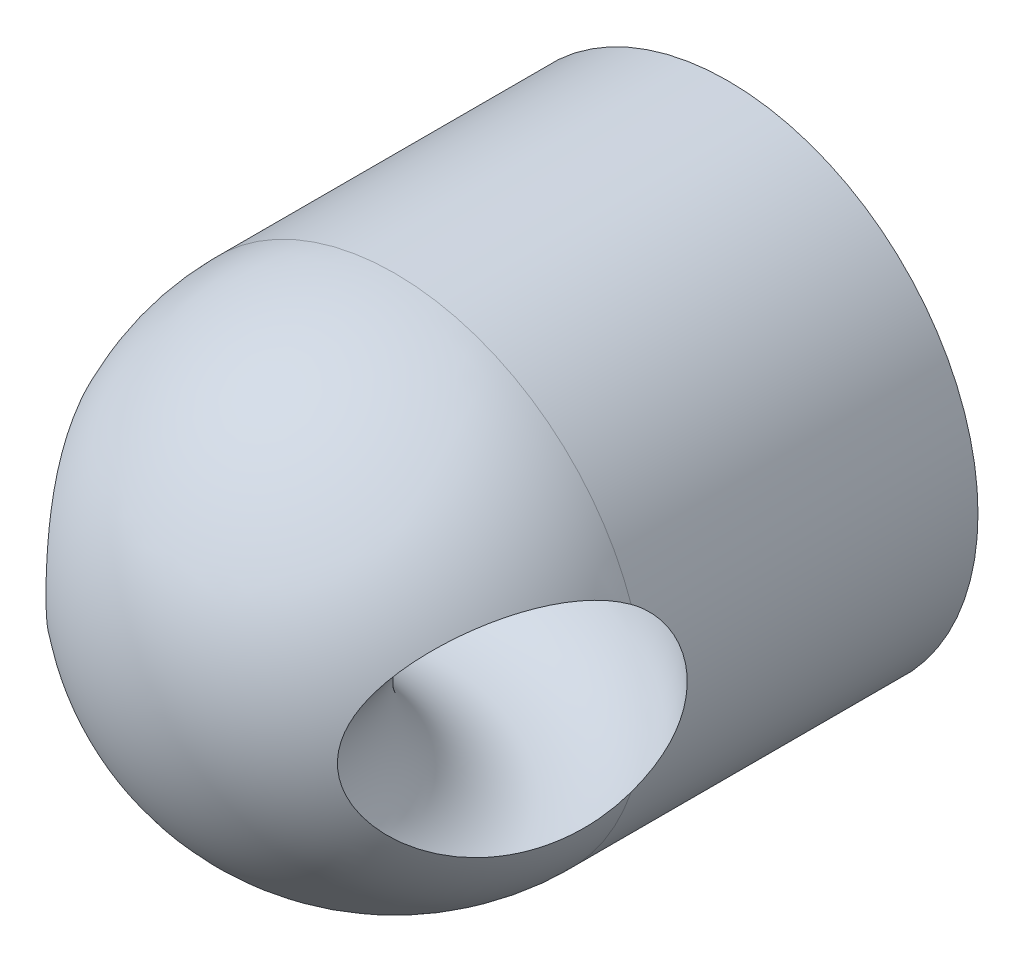
ISO-10303-21;
HEADER;
FILE_DESCRIPTION(('STEP AP214'),'2;1');
FILE_NAME('part.step','',(''),(''),'','','');
FILE_SCHEMA(('AUTOMOTIVE_DESIGN { 1 0 10303 214 1 1 1 1 }'));
ENDSEC;
DATA;
#1=APPLICATION_CONTEXT('core data for automotive mechanical design processes');
#2=APPLICATION_PROTOCOL_DEFINITION('international standard','automotive_design',2000,#1);
#3=PRODUCT_CONTEXT('',#1,'mechanical');
#4=PRODUCT('Part','Part','',(#3));
#5=PRODUCT_RELATED_PRODUCT_CATEGORY('part','',(#4));
#6=PRODUCT_DEFINITION_FORMATION('','',#4);
#7=PRODUCT_DEFINITION_CONTEXT('part definition',#1,'design');
#8=PRODUCT_DEFINITION('design','',#6,#7);
#9=PRODUCT_DEFINITION_SHAPE('','',#8);
#10=(LENGTH_UNIT() NAMED_UNIT(*) SI_UNIT(.MILLI.,.METRE.));
#11=(NAMED_UNIT(*) PLANE_ANGLE_UNIT() SI_UNIT($,.RADIAN.));
#12=(NAMED_UNIT(*) SI_UNIT($,.STERADIAN.) SOLID_ANGLE_UNIT());
#13=UNCERTAINTY_MEASURE_WITH_UNIT(LENGTH_MEASURE(1.E-05),#10,'distance_accuracy_value','');
#14=(GEOMETRIC_REPRESENTATION_CONTEXT(3) GLOBAL_UNCERTAINTY_ASSIGNED_CONTEXT((#13)) GLOBAL_UNIT_ASSIGNED_CONTEXT((#10,
#11,#12)) REPRESENTATION_CONTEXT('',''));
#15=CARTESIAN_POINT('',(0.,0.,0.));
#16=DIRECTION('',(0.,0.,1.));
#17=DIRECTION('',(1.,0.,0.));
#18=AXIS2_PLACEMENT_3D('',#15,#16,#17);
#19=CARTESIAN_POINT('',(0.,0.,8.));
#20=DIRECTION('',(0.,0.,-1.));
#21=DIRECTION('',(-1.,0.,0.));
#22=AXIS2_PLACEMENT_3D('',#19,#20,#21);
#23=CYLINDRICAL_SURFACE('',#22,6.);
#24=CARTESIAN_POINT('',(0.,0.,0.));
#25=DIRECTION('',(0.,0.,1.));
#26=DIRECTION('',(1.,0.,0.));
#27=AXIS2_PLACEMENT_3D('',#24,#25,#26);
#28=CIRCLE('',#27,6.);
#29=CARTESIAN_POINT('',(6.,0.,0.));
#30=VERTEX_POINT('',#29);
#31=EDGE_CURVE('E75',#30,#30,#28,.T.);
#32=ORIENTED_EDGE('',*,*,#31,.T.);
#33=EDGE_LOOP('',(#32));
#34=FACE_BOUND('',#33,.T.);
#35=CARTESIAN_POINT('',(5.67370121304075,-1.95169530028127,8.0002));
#36=CARTESIAN_POINT('',(5.68599165464158,-1.91596066618912,7.94659870233508));
#37=CARTESIAN_POINT('',(5.69864240964863,-1.87809175991697,7.89449088787931));
#38=CARTESIAN_POINT('',(5.72435518776014,-1.79820065644613,7.79365101398529));
#39=CARTESIAN_POINT('',(5.73741731574107,-1.75617739418819,7.74491982569329));
#40=CARTESIAN_POINT('',(5.76363024788389,-1.66813347743621,7.65127351661933));
#41=CARTESIAN_POINT('',(5.77678100414287,-1.62211484402309,7.60635648890833));
#42=CARTESIAN_POINT('',(5.80282479186847,-1.52633391862101,7.52066758172121));
#43=CARTESIAN_POINT('',(5.81571785546878,-1.47657209713231,7.47989518279557));
#44=CARTESIAN_POINT('',(5.85353535174909,-1.32187472547556,7.36407117625558));
#45=CARTESIAN_POINT('',(5.87756453994291,-1.21163549286906,7.29562802598356));
#46=CARTESIAN_POINT('',(5.92051222154973,-0.980483284229017,7.17821883721233));
#47=CARTESIAN_POINT('',(5.93943356291683,-0.859576306259282,7.12924193779696));
#48=CARTESIAN_POINT('',(5.96985061035541,-0.613161795814008,7.05227949700233));
#49=CARTESIAN_POINT('',(5.98149201429484,-0.487801439411124,7.02388014990335));
#50=CARTESIAN_POINT('',(5.9968002171912,-0.23366596902606,6.98678323417766));
#51=CARTESIAN_POINT('',(6.00046299144252,-0.104889164800627,6.97809560875509));
#52=CARTESIAN_POINT('',(5.99943812116912,0.15361927162193,6.98054632656335));
#53=CARTESIAN_POINT('',(5.99467414942324,0.283348922952994,6.99186588885707));
#54=CARTESIAN_POINT('',(5.97712557619025,0.538850161036467,7.0345609499569));
#55=CARTESIAN_POINT('',(5.96434490701593,0.664623656598611,7.06592661598482));
#56=CARTESIAN_POINT('',(5.93207594794299,0.908643911437708,7.14828568006689));
#57=CARTESIAN_POINT('',(5.91258794706094,1.02689099476503,7.19927823241659));
#58=CARTESIAN_POINT('',(5.86893126447188,1.25253987054807,7.32010460611212));
#59=CARTESIAN_POINT('',(5.84476067178426,1.35993720786965,7.38994612437064));
#60=CARTESIAN_POINT('',(5.8075878370291,1.50810359412598,7.50557860550915));
#61=CARTESIAN_POINT('',(5.79536223773041,1.55432243888168,7.54482234619642));
#62=CARTESIAN_POINT('',(5.77073615100168,1.64339050378597,7.62694233187394));
#63=CARTESIAN_POINT('',(5.75833565178879,1.68623949561947,7.66981882258301));
#64=CARTESIAN_POINT('',(5.73365280979072,1.76835182598863,7.75890188624227));
#65=CARTESIAN_POINT('',(5.72137047206934,1.80761501146193,7.80510860119464));
#66=CARTESIAN_POINT('',(5.69718633304153,1.88244738827091,7.90050227360056));
#67=CARTESIAN_POINT('',(5.68528445656254,1.91801731249274,7.94968863669715));
#68=CARTESIAN_POINT('',(5.67370121304075,1.95169530028127,8.0002));
#69=B_SPLINE_CURVE_WITH_KNOTS('',3,(#35,#36,#37,#38,#39,#40,#41,#42,#43,#44,#45,#46,#47,#48,#49,
#50,#51,#52,#53,#54,#55,#56,#57,#58,#59,#60,#61,#62,#63,#64,#65,#66,#67,#68),.UNSPECIFIED.,.F.,
.F.,(4,2,2,2,2,2,2,2,2,2,2,2,2,2,2,2,4),(0.,0.19671049807772,0.393471558589735,0.59013365996096,
0.786771083050742,1.18052446646407,1.57405785137763,1.95943947705816,2.34501545801295,
2.73410178809381,3.12299741446247,3.51187628555212,3.90091419493883,4.08631087499308,
4.27172010528606,4.45713724619035,4.64251752254459),.UNSPECIFIED.);
#70=CARTESIAN_POINT('',(5.67374710839159,-1.95156187450411,8.00000000000692));
#71=VERTEX_POINT('',#70);
#72=CARTESIAN_POINT('',(5.67374710839318,1.9515618744995,8.));
#73=VERTEX_POINT('',#72);
#74=EDGE_CURVE('E59',#71,#73,#69,.T.);
#75=ORIENTED_EDGE('',*,*,#74,.F.);
#76=CARTESIAN_POINT('',(0.,0.,8.));
#77=DIRECTION('',(0.,0.,1.));
#78=DIRECTION('',(1.,0.,0.));
#79=AXIS2_PLACEMENT_3D('',#76,#77,#78);
#80=CIRCLE('',#79,6.);
#81=CARTESIAN_POINT('',(-5.67374710839318,-1.9515618744995,8.));
#82=VERTEX_POINT('',#81);
#83=EDGE_CURVE('E71',#82,#71,#80,.T.);
#84=ORIENTED_EDGE('',*,*,#83,.F.);
#85=CARTESIAN_POINT('',(-5.67370121304075,1.95169530028127,8.0002));
#86=CARTESIAN_POINT('',(-5.68599165464158,1.91596066618912,7.94659870233508));
#87=CARTESIAN_POINT('',(-5.69864240964863,1.87809175991697,7.89449088787931));
#88=CARTESIAN_POINT('',(-5.72435518776014,1.79820065644613,7.79365101398529));
#89=CARTESIAN_POINT('',(-5.73741731574107,1.75617739418819,7.74491982569329));
#90=CARTESIAN_POINT('',(-5.76363024788389,1.66813347743621,7.65127351661933));
#91=CARTESIAN_POINT('',(-5.77678100414287,1.62211484402309,7.60635648890833));
#92=CARTESIAN_POINT('',(-5.80282479186847,1.52633391862101,7.52066758172121));
#93=CARTESIAN_POINT('',(-5.81571785546878,1.47657209713231,7.47989518279557));
#94=CARTESIAN_POINT('',(-5.85353535174909,1.32187472547556,7.36407117625558));
#95=CARTESIAN_POINT('',(-5.87756453994291,1.21163549286906,7.29562802598356));
#96=CARTESIAN_POINT('',(-5.92051222154973,0.980483284229017,7.17821883721233));
#97=CARTESIAN_POINT('',(-5.93943356291683,0.859576306259282,7.12924193779696));
#98=CARTESIAN_POINT('',(-5.96985061035541,0.613161795814008,7.05227949700233));
#99=CARTESIAN_POINT('',(-5.98149201429484,0.487801439411124,7.02388014990335));
#100=CARTESIAN_POINT('',(-5.9968002171912,0.23366596902606,6.98678323417766));
#101=CARTESIAN_POINT('',(-6.00046299144252,0.104889164800627,6.97809560875509));
#102=CARTESIAN_POINT('',(-5.99943812116912,-0.15361927162193,6.98054632656335));
#103=CARTESIAN_POINT('',(-5.99467414942324,-0.283348922952994,6.99186588885707));
#104=CARTESIAN_POINT('',(-5.97712557619025,-0.538850161036467,7.0345609499569));
#105=CARTESIAN_POINT('',(-5.96434490701593,-0.664623656598611,7.06592661598482));
#106=CARTESIAN_POINT('',(-5.93207594794299,-0.908643911437708,7.14828568006689));
#107=CARTESIAN_POINT('',(-5.91258794706094,-1.02689099476503,7.19927823241659));
#108=CARTESIAN_POINT('',(-5.86893126447188,-1.25253987054807,7.32010460611212));
#109=CARTESIAN_POINT('',(-5.84476067178426,-1.35993720786965,7.38994612437064));
#110=CARTESIAN_POINT('',(-5.8075878370291,-1.50810359412598,7.50557860550915));
#111=CARTESIAN_POINT('',(-5.79536223773041,-1.55432243888168,7.54482234619642));
#112=CARTESIAN_POINT('',(-5.77073615100168,-1.64339050378597,7.62694233187394));
#113=CARTESIAN_POINT('',(-5.75833565178879,-1.68623949561947,7.66981882258301));
#114=CARTESIAN_POINT('',(-5.73365280979072,-1.76835182598863,7.75890188624227));
#115=CARTESIAN_POINT('',(-5.72137047206934,-1.80761501146193,7.80510860119464));
#116=CARTESIAN_POINT('',(-5.69718633304153,-1.88244738827091,7.90050227360056));
#117=CARTESIAN_POINT('',(-5.68528445656254,-1.91801731249274,7.94968863669715));
#118=CARTESIAN_POINT('',(-5.67370121304075,-1.95169530028127,8.0002));
#119=B_SPLINE_CURVE_WITH_KNOTS('',3,(#85,#86,#87,#88,#89,#90,#91,#92,#93,#94,#95,#96,#97,#98,
#99,#100,#101,#102,#103,#104,#105,#106,#107,#108,#109,#110,#111,#112,#113,#114,#115,#116,#117,
#118),.UNSPECIFIED.,.F.,.F.,(4,2,2,2,2,2,2,2,2,2,2,2,2,2,2,2,4),(0.,0.19671049807772,
0.393471558589735,0.59013365996096,0.786771083050742,1.18052446646407,1.57405785137763,
1.95943947705816,2.34501545801295,2.73410178809381,3.12299741446247,3.51187628555212,
3.90091419493883,4.08631087499308,4.27172010528606,4.45713724619035,4.64251752254459),.UNSPECIFIED.);
#120=CARTESIAN_POINT('',(-5.67374710839159,1.95156187450411,8.00000000000692));
#121=VERTEX_POINT('',#120);
#122=EDGE_CURVE('E52',#121,#82,#119,.T.);
#123=ORIENTED_EDGE('',*,*,#122,.F.);
#124=EDGE_CURVE('E68',#73,#121,#80,.T.);
#125=ORIENTED_EDGE('',*,*,#124,.F.);
#126=EDGE_LOOP('',(#75,#84,#123,#125));
#127=FACE_BOUND('',#126,.T.);
#128=ADVANCED_FACE('F33',(#34,#127),#23,.T.);
#129=CARTESIAN_POINT('',(0.,0.,8.));
#130=DIRECTION('',(0.,0.,-1.));
#131=DIRECTION('',(-1.,0.,0.));
#132=AXIS2_PLACEMENT_3D('',#129,#130,#131);
#133=CYLINDRICAL_SURFACE('',#132,1.25);
#134=CARTESIAN_POINT('',(0.,0.,0.));
#135=DIRECTION('',(0.,0.,1.));
#136=DIRECTION('',(1.,0.,0.));
#137=AXIS2_PLACEMENT_3D('',#134,#135,#136);
#138=CIRCLE('',#137,1.25);
#139=CARTESIAN_POINT('',(1.25,0.,0.));
#140=VERTEX_POINT('',#139);
#141=EDGE_CURVE('E78',#140,#140,#138,.T.);
#142=ORIENTED_EDGE('',*,*,#141,.F.);
#143=EDGE_LOOP('',(#142));
#144=FACE_BOUND('',#143,.T.);
#145=CARTESIAN_POINT('',(-0.860709432922503,-0.906465262478333,4.71471133439228));
#146=CARTESIAN_POINT('',(-0.810426524394225,-0.954205614656485,4.72816375029273));
#147=CARTESIAN_POINT('',(-0.756097143414659,-0.997819313019008,4.74171540566357));
#148=CARTESIAN_POINT('',(-0.640624417554797,-1.07562443010535,4.76751146240976));
#149=CARTESIAN_POINT('',(-0.579463670153044,-1.10979097705506,4.77975236203255));
#150=CARTESIAN_POINT('',(-0.451714978618799,-1.16763533039575,4.8013804729479));
#151=CARTESIAN_POINT('',(-0.385117194546073,-1.19129359741623,4.81076235803431));
#152=CARTESIAN_POINT('',(-0.248505321685116,-1.22707827719922,4.82526005189616));
#153=CARTESIAN_POINT('',(-0.178495546520238,-1.23921887300058,4.83038110656555));
#154=CARTESIAN_POINT('',(-0.0409302535151951,-1.25113569360775,4.8354107196351));
#155=CARTESIAN_POINT('',(0.0265630588371184,-1.2515232325536,4.83557698426595));
#156=CARTESIAN_POINT('',(0.16059282105183,-1.24146145986611,4.83132552241072));
#157=CARTESIAN_POINT('',(0.227129174178321,-1.23101106035904,4.8269073357537));
#158=CARTESIAN_POINT('',(0.355202741932674,-1.20022193334198,4.81434581942854));
#159=CARTESIAN_POINT('',(0.416831792082249,-1.18021028105182,4.8063261986344));
#160=CARTESIAN_POINT('',(0.53592623940618,-1.1311209662823,4.78760964178421));
#161=CARTESIAN_POINT('',(0.593390502644119,-1.10204084609614,4.77691198008938));
#162=CARTESIAN_POINT('',(0.706341616532303,-1.03354149245998,4.75330943980869));
#163=CARTESIAN_POINT('',(0.76148965166789,-0.993596496185218,4.74030929237294));
#164=CARTESIAN_POINT('',(0.864563877374012,-0.905337394755702,4.71403005807556));
#165=CARTESIAN_POINT('',(0.912487758987057,-0.857020624406215,4.70075088357094));
#166=CARTESIAN_POINT('',(1.0022833435343,-0.750357353435595,4.67456374524815));
#167=CARTESIAN_POINT('',(1.04370720520006,-0.69161835642598,4.66171155419329));
#168=CARTESIAN_POINT('',(1.11604542367408,-0.567535559207603,4.63851138153527));
#169=CARTESIAN_POINT('',(1.14696166962856,-0.502192948994699,4.62816294988198));
#170=CARTESIAN_POINT('',(1.19650528346757,-0.368534559653768,4.61127619471879));
#171=CARTESIAN_POINT('',(1.21543778318503,-0.300344175038212,4.60464380687101));
#172=CARTESIAN_POINT('',(1.2415341695581,-0.161487857804868,4.59544517087231));
#173=CARTESIAN_POINT('',(1.24870234785813,-0.0908228375509276,4.59287743993977));
#174=CARTESIAN_POINT('',(1.2509164948242,0.0470165562926394,4.59208685319036));
#175=CARTESIAN_POINT('',(1.24657553122777,0.114180652075129,4.59364425587572));
#176=CARTESIAN_POINT('',(1.22723278775577,0.246752029988312,4.6004955197342));
#177=CARTESIAN_POINT('',(1.21223149503737,0.312159392256706,4.60578921016586));
#178=CARTESIAN_POINT('',(1.172242443697,0.439029115743233,4.61958743257054));
#179=CARTESIAN_POINT('',(1.147315848213,0.500513010887259,4.62807228208336));
#180=CARTESIAN_POINT('',(1.08827673409165,0.618471263834338,4.64750552908523));
#181=CARTESIAN_POINT('',(1.0541622982794,0.674944572833262,4.65845444065776));
#182=CARTESIAN_POINT('',(0.975915567228504,0.784093808331723,4.68239615983618));
#183=CARTESIAN_POINT('',(0.931394501047881,0.836475380473076,4.69545983918618));
#184=CARTESIAN_POINT('',(0.834433144675624,0.933228755281607,4.721954773184));
#185=CARTESIAN_POINT('',(0.78198958903525,0.977597238524166,4.73538617752093));
#186=CARTESIAN_POINT('',(0.667975877264332,1.05897060091372,4.76174694273844));
#187=CARTESIAN_POINT('',(0.606111593582106,1.09558005791015,4.77463036228387));
#188=CARTESIAN_POINT('',(0.476594833180185,1.15780557187031,4.7975748002779));
#189=CARTESIAN_POINT('',(0.408944383938021,1.18342546081396,4.80763680210918));
#190=CARTESIAN_POINT('',(0.271999577244197,1.22205181566726,4.82317915747544));
#191=CARTESIAN_POINT('',(0.202829082951111,1.23543930472926,4.82879712213292));
#192=CARTESIAN_POINT('',(0.063015626331386,1.25038582928624,4.83508583304597));
#193=CARTESIAN_POINT('',(-0.00762650012141124,1.25195140522398,4.83575931481814));
#194=CARTESIAN_POINT('',(-0.143099959179563,1.24350545906636,4.8321885354864));
#195=CARTESIAN_POINT('',(-0.207992434768774,1.23429517268433,4.82828458362657));
#196=CARTESIAN_POINT('',(-0.335221906588466,1.20597493122767,4.8166669323687));
#197=CARTESIAN_POINT('',(-0.397558379446036,1.18686295947773,4.80895245689661));
#198=CARTESIAN_POINT('',(-0.519026907263564,1.13905027497509,4.79056686035521));
#199=CARTESIAN_POINT('',(-0.578098718678255,1.11021333260846,4.77985412355277));
#200=CARTESIAN_POINT('',(-0.690778106687979,1.04384135658555,4.75676029635634));
#201=CARTESIAN_POINT('',(-0.74438385894874,1.0063034325111,4.74437865213376));
#202=CARTESIAN_POINT('',(-0.848739949556403,0.920346286411431,4.71828507528715));
#203=CARTESIAN_POINT('',(-0.898993060598146,0.871331198743557,4.7045421535574));
#204=CARTESIAN_POINT('',(-0.990720122292803,0.765429042275302,4.6780484882566));
#205=CARTESIAN_POINT('',(-1.03219277160768,0.708540808671936,4.66529789193334));
#206=CARTESIAN_POINT('',(-1.10579419021506,0.587226563405466,4.64187907067577));
#207=CARTESIAN_POINT('',(-1.1377522618247,0.522688919984537,4.63124989965818));
#208=CARTESIAN_POINT('',(-1.19021436979616,0.388667961482949,4.613458652476));
#209=CARTESIAN_POINT('',(-1.21072241317466,0.319186386174781,4.60629536351918));
#210=CARTESIAN_POINT('',(-1.23875121019791,0.180905007953373,4.59643400034317));
#211=CARTESIAN_POINT('',(-1.2468588092687,0.112238460546788,4.5935344297455));
#212=CARTESIAN_POINT('',(-1.25163694586789,-0.025526502288814,4.59183048164046));
#213=CARTESIAN_POINT('',(-1.24831153571524,-0.0946247560375364,4.59302465314556));
#214=CARTESIAN_POINT('',(-1.23070820760329,-0.22858946187083,4.59926787778937));
#215=CARTESIAN_POINT('',(-1.21684276222096,-0.293517680436513,4.60417172275324));
#216=CARTESIAN_POINT('',(-1.17914153220597,-0.42010635390333,4.61722615185485));
#217=CARTESIAN_POINT('',(-1.15529900231058,-0.481764566197407,4.6253789323403));
#218=CARTESIAN_POINT('',(-1.09779917818931,-0.60154097152995,4.64441993006958));
#219=CARTESIAN_POINT('',(-1.06393769122422,-0.659551578702807,4.65536432883792));
#220=CARTESIAN_POINT('',(-0.987633180134523,-0.769104085612096,4.67888699219256));
#221=CARTESIAN_POINT('',(-0.945209156362605,-0.820659905186626,4.69146161757176));
#222=CARTESIAN_POINT('',(-0.886557468142127,-0.881386636100883,4.70772975093322));
#223=CARTESIAN_POINT('',(-0.873769948586234,-0.894065152069761,4.71121719505697));
#224=CARTESIAN_POINT('',(-0.860709432922503,-0.906465262478333,4.71471133439228));
#225=B_SPLINE_CURVE_WITH_KNOTS('',3,(#145,#146,#147,#148,#149,#150,#151,#152,#153,#154,#155,
#156,#157,#158,#159,#160,#161,#162,#163,#164,#165,#166,#167,#168,#169,#170,#171,#172,#173,#174,
#175,#176,#177,#178,#179,#180,#181,#182,#183,#184,#185,#186,#187,#188,#189,#190,#191,#192,#193,
#194,#195,#196,#197,#198,#199,#200,#201,#202,#203,#204,#205,#206,#207,#208,#209,#210,#211,#212,
#213,#214,#215,#216,#217,#218,#219,#220,#221,#222,#223,#224),.UNSPECIFIED.,.T.,.F.,(4,2,2,2,2,2,
2,2,2,2,2,2,2,2,2,2,2,2,2,2,2,2,2,2,2,2,2,2,2,2,2,2,2,2,2,2,2,2,2,4),(0.,0.211842157102101,
0.424236838572541,0.637024815668346,0.849550420923723,1.05100181523832,1.25247343248481,
1.44749895960956,1.64257738792402,1.84965012929375,2.05678891480245,2.27476530057937,
2.49270247599909,2.70484000866175,2.91690013597655,3.11789407067922,3.31887882092469,
3.51864374061623,3.71845037646754,3.9274520550647,4.13654011507397,4.35455810328239,
4.57250000833394,4.78339565598731,4.99417461761634,5.1902266994724,5.38631872694331,
5.58528038430889,5.78430823060465,5.9979231025226,6.21156961182686,6.42884545203076,
6.64604520731257,6.85260795096571,7.05909748801178,7.25789754922068,7.45683223199167,
7.66013911404629,7.86299972042192,7.91802374134773),.UNSPECIFIED.);
#226=CARTESIAN_POINT('',(-0.860709432922503,-0.906465262478333,4.71471133439228));
#227=VERTEX_POINT('',#226);
#228=EDGE_CURVE('E101',#227,#227,#225,.T.);
#229=ORIENTED_EDGE('',*,*,#228,.T.);
#230=EDGE_LOOP('',(#229));
#231=FACE_BOUND('',#230,.T.);
#232=ADVANCED_FACE('F105',(#144,#231),#133,.F.);
#233=CARTESIAN_POINT('',(0.,0.,8.));
#234=DIRECTION('',(0.,0.,1.));
#235=DIRECTION('',(0.,1.,0.));
#236=AXIS2_PLACEMENT_3D('',#233,#234,#235);
#237=SPHERICAL_SURFACE('',#236,6.);
#238=ORIENTED_EDGE('',*,*,#83,.T.);
#239=CARTESIAN_POINT('',(5.67379300566306,-1.95142842269167,7.9998));
#240=CARTESIAN_POINT('',(5.65366503854172,-2.00998526173535,8.08755444263342));
#241=CARTESIAN_POINT('',(5.63214025076951,-2.06369045249054,8.17813440558751));
#242=CARTESIAN_POINT('',(5.58635418559649,-2.1614658082241,8.36356407934387));
#243=CARTESIAN_POINT('',(5.56209618189776,-2.20554731780502,8.45840860211587));
#244=CARTESIAN_POINT('',(5.51101677157919,-2.28403011252677,8.65058391208141));
#245=CARTESIAN_POINT('',(5.48421274378528,-2.31849148030131,8.74789492882039));
#246=CARTESIAN_POINT('',(5.42797064430606,-2.37831297784742,8.94452392937696));
#247=CARTESIAN_POINT('',(5.39853200298866,-2.40367113343752,9.04384234360474));
#248=CARTESIAN_POINT('',(5.31413431065986,-2.46111599328996,9.31812787101554));
#249=CARTESIAN_POINT('',(5.2565202951024,-2.48410966084894,9.49425589317501));
#250=CARTESIAN_POINT('',(5.1339946522237,-2.50418996681531,9.84551447605521));
#251=CARTESIAN_POINT('',(5.06907482510911,-2.50124720291183,10.0206436794754));
#252=CARTESIAN_POINT('',(4.92205671242406,-2.46808820683156,10.3934076651222));
#253=CARTESIAN_POINT('',(4.83886314557432,-2.4336501399519,10.5902436914415));
#254=CARTESIAN_POINT('',(4.66563513330485,-2.33262048812604,10.9727749818876));
#255=CARTESIAN_POINT('',(4.57559132563257,-2.26598420760053,11.1584543549899));
#256=CARTESIAN_POINT('',(4.43579244719212,-2.14052800012321,11.4285125528596));
#257=CARTESIAN_POINT('',(4.38729172390172,-2.09312240439831,11.5189900678984));
#258=CARTESIAN_POINT('',(4.2899203984603,-1.98960183498292,11.6947019523688));
#259=CARTESIAN_POINT('',(4.24104969432037,-1.93348436995568,11.7799348122181));
#260=CARTESIAN_POINT('',(4.143890071752,-1.81258097098167,11.9440395291942));
#261=CARTESIAN_POINT('',(4.09560010785886,-1.74781442964229,12.0229250018137));
#262=CARTESIAN_POINT('',(4.00063024989073,-1.60938098907252,12.1734335149991));
#263=CARTESIAN_POINT('',(3.95394907754026,-1.53572137573854,12.2450624134031));
#264=CARTESIAN_POINT('',(3.85775926888475,-1.36905208874227,12.3885762647611));
#265=CARTESIAN_POINT('',(3.80867035762876,-1.27477179143376,12.4592871662163));
#266=CARTESIAN_POINT('',(3.7174265473309,-1.07445891592194,12.5872027944123));
#267=CARTESIAN_POINT('',(3.67525971645224,-0.968447099419288,12.6444308377656));
#268=CARTESIAN_POINT('',(3.60904127699666,-0.767307631775516,12.7324948484602));
#269=CARTESIAN_POINT('',(3.58305804617062,-0.674137341655884,12.7663075025818));
#270=CARTESIAN_POINT('',(3.54050860834101,-0.482019526135274,12.8210852328393));
#271=CARTESIAN_POINT('',(3.52393300258511,-0.383077876050693,12.8420631332642));
#272=CARTESIAN_POINT('',(3.50209918950817,-0.181227276724118,12.8696015930494));
#273=CARTESIAN_POINT('',(3.49691744720558,-0.0782962122565538,12.8760647490728));
#274=CARTESIAN_POINT('',(3.49884651351328,0.127265762415663,12.8736474820296));
#275=CARTESIAN_POINT('',(3.50595679481718,0.229896685306679,12.8647677171475));
#276=CARTESIAN_POINT('',(3.53016417380257,0.421161046356896,12.8341616111879));
#277=CARTESIAN_POINT('',(3.54618515492108,0.510164269884047,12.8138168410513));
#278=CARTESIAN_POINT('',(3.58578993677637,0.683340402888368,12.7627419302748));
#279=CARTESIAN_POINT('',(3.60937764995459,0.767510786903212,12.7320064165711));
#280=CARTESIAN_POINT('',(3.67502703155782,0.968855004935887,12.6447954393355));
#281=CARTESIAN_POINT('',(3.72053303636275,1.08261029394753,12.5830359978764));
#282=CARTESIAN_POINT('',(3.81933154715501,1.29663729123111,12.4441243153521));
#283=CARTESIAN_POINT('',(3.87264373482166,1.39687364949695,12.366932980724));
#284=CARTESIAN_POINT('',(3.96630829788958,1.55500649054686,12.2260297728368));
#285=CARTESIAN_POINT('',(4.0055929108331,1.61643290256746,12.1654922926616));
#286=CARTESIAN_POINT('',(4.08531103115792,1.73298674940743,12.0393027324865));
#287=CARTESIAN_POINT('',(4.12574495464188,1.78811186564694,11.9736487847156));
#288=CARTESIAN_POINT('',(4.24772078545965,1.94420099320749,11.7699821040298));
#289=CARTESIAN_POINT('',(4.32997254639687,2.03593677716484,11.625211470296));
#290=CARTESIAN_POINT('',(4.49429384475695,2.19686818640491,11.3185415456977));
#291=CARTESIAN_POINT('',(4.57631617726371,2.26550022347582,11.1563261981952));
#292=CARTESIAN_POINT('',(4.73576682369502,2.37715444487854,10.8212040461423));
#293=CARTESIAN_POINT('',(4.81319511118085,2.42017648183768,10.6482971800738));
#294=CARTESIAN_POINT('',(4.97315649382468,2.48445960271983,10.2682811348446));
#295=CARTESIAN_POINT('',(5.05465714951859,2.50138236151429,10.0599875412347));
#296=CARTESIAN_POINT('',(5.20759261775503,2.49844212570241,9.6397401215879));
#297=CARTESIAN_POINT('',(5.2790224076331,2.47856084508925,9.42778452793081));
#298=CARTESIAN_POINT('',(5.40035481442917,2.40609577467744,9.04045826573654));
#299=CARTESIAN_POINT('',(5.45187728229999,2.35910109934083,8.86454130586393));
#300=CARTESIAN_POINT('',(5.54641897928792,2.23629682417446,8.52102665862184));
#301=CARTESIAN_POINT('',(5.58946627812162,2.160584860559,8.35340293410467));
#302=CARTESIAN_POINT('',(5.64413895302719,2.03310073405411,8.12740118840171));
#303=CARTESIAN_POINT('',(5.65933339717406,1.99350908963931,8.06284990899023));
#304=CARTESIAN_POINT('',(5.67379300566306,1.95142842269167,7.9998));
#305=B_SPLINE_CURVE_WITH_KNOTS('',3,(#239,#240,#241,#242,#243,#244,#245,#246,#247,#248,#249,
#250,#251,#252,#253,#254,#255,#256,#257,#258,#259,#260,#261,#262,#263,#264,#265,#266,#267,#268,
#269,#270,#271,#272,#273,#274,#275,#276,#277,#278,#279,#280,#281,#282,#283,#284,#285,#286,#287,
#288,#289,#290,#291,#292,#293,#294,#295,#296,#297,#298,#299,#300,#301,#302,#303,#304),
.UNSPECIFIED.,.F.,.F.,(4,2,2,2,2,2,2,2,2,2,2,2,2,2,2,2,2,2,2,2,2,2,2,2,2,2,2,2,2,2,2,2,4),(0.,
0.321937854731395,0.643494128074955,0.962994741897352,1.28256460289068,1.84053681323519,
2.39914163877584,3.04571108533682,3.69318064957817,4.03202743536165,4.37097130040295,
4.70916757415527,5.04708862782878,5.42888069347051,5.81000757848684,6.11620905301979,
6.42210407393378,6.73004579135919,7.03797429894955,7.3149391094639,7.59204735837678,
8.00139473727364,8.4117925636012,8.69574705315196,8.9798056905212,9.54766701106928,
10.128517732421,10.7093717962442,11.3791264069609,12.0492138731131,12.6147041053793,
13.1782887092306,13.4097925320082),.UNSPECIFIED.);
#306=EDGE_CURVE('E11',#71,#73,#305,.T.);
#307=ORIENTED_EDGE('',*,*,#306,.T.);
#308=ORIENTED_EDGE('',*,*,#124,.T.);
#309=CARTESIAN_POINT('',(-5.67379300566306,1.95142842269167,7.9998));
#310=CARTESIAN_POINT('',(-5.65366503854172,2.00998526173535,8.08755444263342));
#311=CARTESIAN_POINT('',(-5.63214025076951,2.06369045249054,8.17813440558751));
#312=CARTESIAN_POINT('',(-5.58635418559649,2.1614658082241,8.36356407934387));
#313=CARTESIAN_POINT('',(-5.56209618189776,2.20554731780502,8.45840860211587));
#314=CARTESIAN_POINT('',(-5.51101677157919,2.28403011252677,8.65058391208141));
#315=CARTESIAN_POINT('',(-5.48421274378528,2.31849148030131,8.74789492882039));
#316=CARTESIAN_POINT('',(-5.42797064430606,2.37831297784742,8.94452392937696));
#317=CARTESIAN_POINT('',(-5.39853200298866,2.40367113343752,9.04384234360474));
#318=CARTESIAN_POINT('',(-5.31413431065986,2.46111599328996,9.31812787101554));
#319=CARTESIAN_POINT('',(-5.2565202951024,2.48410966084894,9.49425589317501));
#320=CARTESIAN_POINT('',(-5.1339946522237,2.50418996681531,9.84551447605521));
#321=CARTESIAN_POINT('',(-5.06907482510911,2.50124720291183,10.0206436794754));
#322=CARTESIAN_POINT('',(-4.92205671242406,2.46808820683156,10.3934076651222));
#323=CARTESIAN_POINT('',(-4.83886314557432,2.4336501399519,10.5902436914415));
#324=CARTESIAN_POINT('',(-4.66563513330485,2.33262048812604,10.9727749818876));
#325=CARTESIAN_POINT('',(-4.57559132563257,2.26598420760053,11.1584543549899));
#326=CARTESIAN_POINT('',(-4.43579244719212,2.14052800012321,11.4285125528596));
#327=CARTESIAN_POINT('',(-4.38729172390172,2.09312240439831,11.5189900678984));
#328=CARTESIAN_POINT('',(-4.2899203984603,1.98960183498292,11.6947019523688));
#329=CARTESIAN_POINT('',(-4.24104969432037,1.93348436995568,11.7799348122181));
#330=CARTESIAN_POINT('',(-4.143890071752,1.81258097098167,11.9440395291942));
#331=CARTESIAN_POINT('',(-4.09560010785886,1.74781442964229,12.0229250018137));
#332=CARTESIAN_POINT('',(-4.00063024989073,1.60938098907252,12.1734335149991));
#333=CARTESIAN_POINT('',(-3.95394907754026,1.53572137573854,12.2450624134031));
#334=CARTESIAN_POINT('',(-3.85775926888475,1.36905208874227,12.3885762647611));
#335=CARTESIAN_POINT('',(-3.80867035762876,1.27477179143376,12.4592871662163));
#336=CARTESIAN_POINT('',(-3.7174265473309,1.07445891592194,12.5872027944123));
#337=CARTESIAN_POINT('',(-3.67525971645224,0.968447099419288,12.6444308377656));
#338=CARTESIAN_POINT('',(-3.60904127699666,0.767307631775516,12.7324948484602));
#339=CARTESIAN_POINT('',(-3.58305804617062,0.674137341655884,12.7663075025818));
#340=CARTESIAN_POINT('',(-3.54050860834101,0.482019526135274,12.8210852328393));
#341=CARTESIAN_POINT('',(-3.52393300258511,0.383077876050693,12.8420631332642));
#342=CARTESIAN_POINT('',(-3.50209918950817,0.181227276724118,12.8696015930494));
#343=CARTESIAN_POINT('',(-3.49691744720558,0.0782962122565538,12.8760647490728));
#344=CARTESIAN_POINT('',(-3.49884651351328,-0.127265762415663,12.8736474820296));
#345=CARTESIAN_POINT('',(-3.50595679481718,-0.229896685306679,12.8647677171475));
#346=CARTESIAN_POINT('',(-3.53016417380257,-0.421161046356896,12.8341616111879));
#347=CARTESIAN_POINT('',(-3.54618515492108,-0.510164269884047,12.8138168410513));
#348=CARTESIAN_POINT('',(-3.58578993677637,-0.683340402888368,12.7627419302748));
#349=CARTESIAN_POINT('',(-3.60937764995459,-0.767510786903212,12.7320064165711));
#350=CARTESIAN_POINT('',(-3.67502703155782,-0.968855004935887,12.6447954393355));
#351=CARTESIAN_POINT('',(-3.72053303636275,-1.08261029394753,12.5830359978764));
#352=CARTESIAN_POINT('',(-3.81933154715501,-1.29663729123111,12.4441243153521));
#353=CARTESIAN_POINT('',(-3.87264373482166,-1.39687364949695,12.366932980724));
#354=CARTESIAN_POINT('',(-3.96630829788958,-1.55500649054686,12.2260297728368));
#355=CARTESIAN_POINT('',(-4.0055929108331,-1.61643290256746,12.1654922926616));
#356=CARTESIAN_POINT('',(-4.08531103115792,-1.73298674940743,12.0393027324865));
#357=CARTESIAN_POINT('',(-4.12574495464188,-1.78811186564694,11.9736487847156));
#358=CARTESIAN_POINT('',(-4.24772078545965,-1.94420099320749,11.7699821040298));
#359=CARTESIAN_POINT('',(-4.32997254639687,-2.03593677716484,11.625211470296));
#360=CARTESIAN_POINT('',(-4.49429384475695,-2.19686818640491,11.3185415456977));
#361=CARTESIAN_POINT('',(-4.57631617726371,-2.26550022347582,11.1563261981952));
#362=CARTESIAN_POINT('',(-4.73576682369502,-2.37715444487854,10.8212040461423));
#363=CARTESIAN_POINT('',(-4.81319511118085,-2.42017648183768,10.6482971800738));
#364=CARTESIAN_POINT('',(-4.97315649382468,-2.48445960271983,10.2682811348446));
#365=CARTESIAN_POINT('',(-5.05465714951859,-2.50138236151429,10.0599875412347));
#366=CARTESIAN_POINT('',(-5.20759261775503,-2.49844212570241,9.6397401215879));
#367=CARTESIAN_POINT('',(-5.2790224076331,-2.47856084508925,9.42778452793081));
#368=CARTESIAN_POINT('',(-5.40035481442917,-2.40609577467744,9.04045826573654));
#369=CARTESIAN_POINT('',(-5.45187728229999,-2.35910109934083,8.86454130586393));
#370=CARTESIAN_POINT('',(-5.54641897928792,-2.23629682417446,8.52102665862184));
#371=CARTESIAN_POINT('',(-5.58946627812162,-2.160584860559,8.35340293410467));
#372=CARTESIAN_POINT('',(-5.64413895302719,-2.03310073405411,8.12740118840171));
#373=CARTESIAN_POINT('',(-5.65933339717406,-1.99350908963931,8.06284990899023));
#374=CARTESIAN_POINT('',(-5.67379300566306,-1.95142842269167,7.9998));
#375=B_SPLINE_CURVE_WITH_KNOTS('',3,(#309,#310,#311,#312,#313,#314,#315,#316,#317,#318,#319,
#320,#321,#322,#323,#324,#325,#326,#327,#328,#329,#330,#331,#332,#333,#334,#335,#336,#337,#338,
#339,#340,#341,#342,#343,#344,#345,#346,#347,#348,#349,#350,#351,#352,#353,#354,#355,#356,#357,
#358,#359,#360,#361,#362,#363,#364,#365,#366,#367,#368,#369,#370,#371,#372,#373,#374),
.UNSPECIFIED.,.F.,.F.,(4,2,2,2,2,2,2,2,2,2,2,2,2,2,2,2,2,2,2,2,2,2,2,2,2,2,2,2,2,2,2,2,4),(0.,
0.321937854731395,0.643494128074955,0.962994741897352,1.28256460289068,1.84053681323519,
2.39914163877584,3.04571108533682,3.69318064957817,4.03202743536165,4.37097130040295,
4.70916757415527,5.04708862782878,5.42888069347051,5.81000757848684,6.11620905301979,
6.42210407393378,6.73004579135919,7.03797429894955,7.3149391094639,7.59204735837678,
8.00139473727364,8.4117925636012,8.69574705315196,8.9798056905212,9.54766701106928,
10.128517732421,10.7093717962442,11.3791264069609,12.0492138731131,12.6147041053793,
13.1782887092306,13.4097925320082),.UNSPECIFIED.);
#376=EDGE_CURVE('E46',#121,#82,#375,.T.);
#377=ORIENTED_EDGE('',*,*,#376,.T.);
#378=EDGE_LOOP('',(#238,#307,#308,#377));
#379=FACE_BOUND('',#378,.T.);
#380=ADVANCED_FACE('F73',(#379),#237,.T.);
#381=CARTESIAN_POINT('',(0.,0.,0.));
#382=DIRECTION('',(0.,0.,1.));
#383=DIRECTION('',(1.,0.,0.));
#384=AXIS2_PLACEMENT_3D('',#381,#382,#383);
#385=PLANE('',#384);
#386=ORIENTED_EDGE('',*,*,#31,.F.);
#387=EDGE_LOOP('',(#386));
#388=FACE_BOUND('',#387,.T.);
#389=ORIENTED_EDGE('',*,*,#141,.T.);
#390=EDGE_LOOP('',(#389));
#391=FACE_BOUND('',#390,.T.);
#392=ADVANCED_FACE('F88',(#388,#391),#385,.F.);
#393=CARTESIAN_POINT('',(0.,0.,13.));
#394=DIRECTION('',(0.,1.,0.));
#395=DIRECTION('',(0.,0.,1.));
#396=AXIS2_PLACEMENT_3D('',#393,#394,#395);
#397=TOROIDAL_SURFACE('',#396,6.,2.5);
#398=ORIENTED_EDGE('',*,*,#228,.F.);
#399=EDGE_LOOP('',(#398));
#400=FACE_BOUND('',#399,.T.);
#401=ORIENTED_EDGE('',*,*,#122,.T.);
#402=ORIENTED_EDGE('',*,*,#376,.F.);
#403=EDGE_LOOP('',(#401,#402));
#404=FACE_BOUND('',#403,.T.);
#405=ORIENTED_EDGE('',*,*,#74,.T.);
#406=ORIENTED_EDGE('',*,*,#306,.F.);
#407=EDGE_LOOP('',(#405,#406));
#408=FACE_BOUND('',#407,.T.);
#409=ADVANCED_FACE('F63',(#400,#404,#408),#397,.F.);
#410=CLOSED_SHELL('',(#128,#232,#380,#392,#409));
#411=MANIFOLD_SOLID_BREP('B2',#410);
#412=ADVANCED_BREP_SHAPE_REPRESENTATION('',(#18,#411),#14);
#413=SHAPE_DEFINITION_REPRESENTATION(#9,#412);
ENDSEC;
END-ISO-10303-21;
